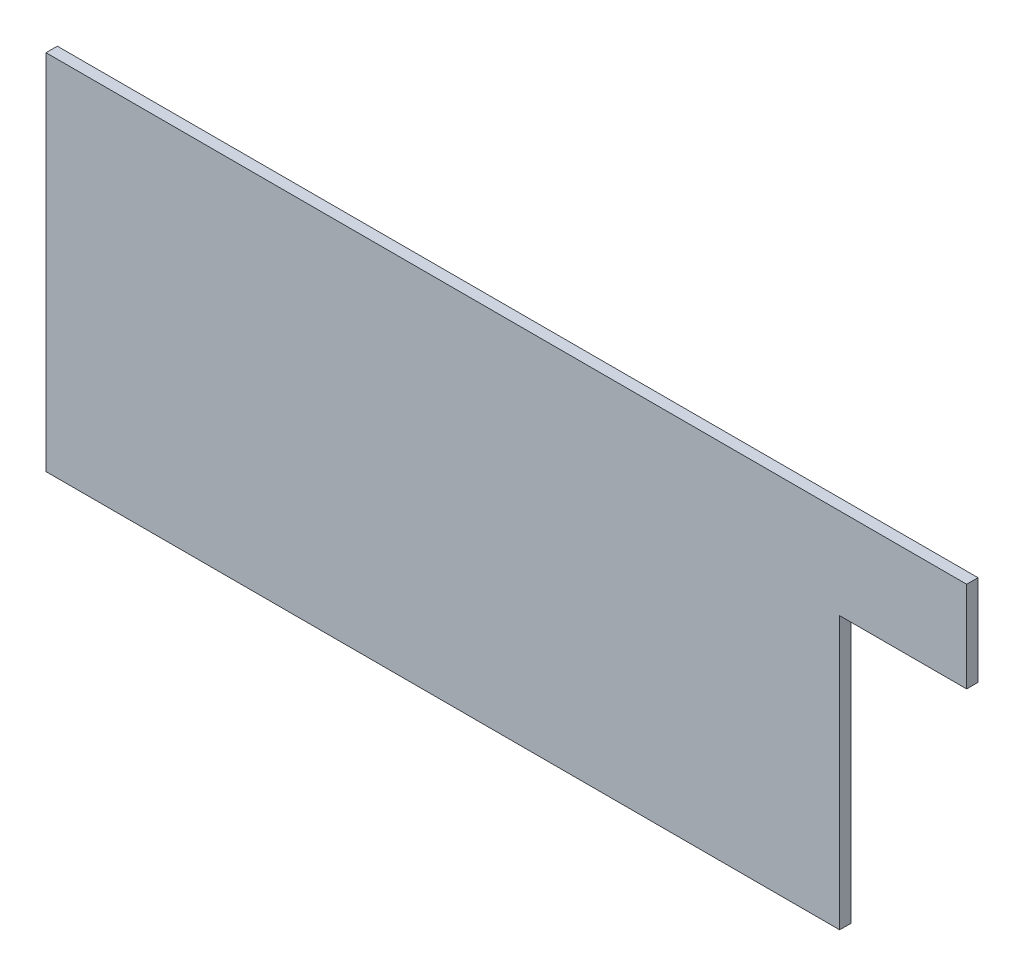
ISO-10303-21;
HEADER;
FILE_DESCRIPTION(('STEP AP214'),'2;1');
FILE_NAME('part.step','',(''),(''),'','','');
FILE_SCHEMA(('AUTOMOTIVE_DESIGN { 1 0 10303 214 1 1 1 1 }'));
ENDSEC;
DATA;
#1=APPLICATION_CONTEXT('core data for automotive mechanical design processes');
#2=APPLICATION_PROTOCOL_DEFINITION('international standard','automotive_design',2000,#1);
#3=PRODUCT_CONTEXT('',#1,'mechanical');
#4=PRODUCT('Part','Part','',(#3));
#5=PRODUCT_RELATED_PRODUCT_CATEGORY('part','',(#4));
#6=PRODUCT_DEFINITION_FORMATION('','',#4);
#7=PRODUCT_DEFINITION_CONTEXT('part definition',#1,'design');
#8=PRODUCT_DEFINITION('design','',#6,#7);
#9=PRODUCT_DEFINITION_SHAPE('','',#8);
#10=(LENGTH_UNIT() NAMED_UNIT(*) SI_UNIT(.MILLI.,.METRE.));
#11=(NAMED_UNIT(*) PLANE_ANGLE_UNIT() SI_UNIT($,.RADIAN.));
#12=(NAMED_UNIT(*) SI_UNIT($,.STERADIAN.) SOLID_ANGLE_UNIT());
#13=UNCERTAINTY_MEASURE_WITH_UNIT(LENGTH_MEASURE(1.E-05),#10,'distance_accuracy_value','');
#14=(GEOMETRIC_REPRESENTATION_CONTEXT(3) GLOBAL_UNCERTAINTY_ASSIGNED_CONTEXT((#13)) GLOBAL_UNIT_ASSIGNED_CONTEXT((#10,
#11,#12)) REPRESENTATION_CONTEXT('',''));
#15=CARTESIAN_POINT('',(0.,0.,0.));
#16=DIRECTION('',(0.,0.,1.));
#17=DIRECTION('',(1.,0.,0.));
#18=AXIS2_PLACEMENT_3D('',#15,#16,#17);
#19=CARTESIAN_POINT('',(0.,0.,3.175));
#20=DIRECTION('',(1.,0.,0.));
#21=DIRECTION('',(0.,0.,-1.));
#22=AXIS2_PLACEMENT_3D('',#19,#20,#21);
#23=PLANE('',#22);
#24=DIRECTION('',(0.,-1.,0.));
#25=VECTOR('',#24,1.);
#26=CARTESIAN_POINT('',(0.,0.,0.));
#27=LINE('',#26,#25);
#28=CARTESIAN_POINT('',(0.,101.6,0.));
#29=VERTEX_POINT('',#28);
#30=CARTESIAN_POINT('',(0.,0.,0.));
#31=VERTEX_POINT('',#30);
#32=EDGE_CURVE('E133',#29,#31,#27,.T.);
#33=ORIENTED_EDGE('',*,*,#32,.T.);
#34=DIRECTION('',(0.,0.,-1.));
#35=VECTOR('',#34,1.);
#36=CARTESIAN_POINT('',(0.,0.,3.175));
#37=LINE('',#36,#35);
#38=CARTESIAN_POINT('',(0.,0.,3.175));
#39=VERTEX_POINT('',#38);
#40=EDGE_CURVE('E11',#39,#31,#37,.T.);
#41=ORIENTED_EDGE('',*,*,#40,.F.);
#42=DIRECTION('',(0.,-1.,0.));
#43=VECTOR('',#42,1.);
#44=CARTESIAN_POINT('',(0.,0.,3.175));
#45=LINE('',#44,#43);
#46=CARTESIAN_POINT('',(0.,101.6,3.175));
#47=VERTEX_POINT('',#46);
#48=EDGE_CURVE('E150',#47,#39,#45,.T.);
#49=ORIENTED_EDGE('',*,*,#48,.F.);
#50=DIRECTION('',(0.,0.,-1.));
#51=VECTOR('',#50,1.);
#52=CARTESIAN_POINT('',(0.,101.6,3.175));
#53=LINE('',#52,#51);
#54=EDGE_CURVE('E129',#47,#29,#53,.T.);
#55=ORIENTED_EDGE('',*,*,#54,.T.);
#56=EDGE_LOOP('',(#33,#41,#49,#55));
#57=FACE_BOUND('',#56,.T.);
#58=ADVANCED_FACE('F43',(#57),#23,.F.);
#59=CARTESIAN_POINT('',(0.,0.,3.175));
#60=DIRECTION('',(0.,1.,0.));
#61=DIRECTION('',(0.,0.,1.));
#62=AXIS2_PLACEMENT_3D('',#59,#60,#61);
#63=PLANE('',#62);
#64=DIRECTION('',(1.,0.,0.));
#65=VECTOR('',#64,1.);
#66=CARTESIAN_POINT('',(0.,0.,0.));
#67=LINE('',#66,#65);
#68=CARTESIAN_POINT('',(222.25,0.,0.));
#69=VERTEX_POINT('',#68);
#70=EDGE_CURVE('E137',#31,#69,#67,.T.);
#71=ORIENTED_EDGE('',*,*,#70,.T.);
#72=DIRECTION('',(0.,0.,-1.));
#73=VECTOR('',#72,1.);
#74=CARTESIAN_POINT('',(222.25,0.,3.175));
#75=LINE('',#74,#73);
#76=CARTESIAN_POINT('',(222.25,0.,3.175));
#77=VERTEX_POINT('',#76);
#78=EDGE_CURVE('E52',#77,#69,#75,.T.);
#79=ORIENTED_EDGE('',*,*,#78,.F.);
#80=DIRECTION('',(1.,0.,0.));
#81=VECTOR('',#80,1.);
#82=CARTESIAN_POINT('',(0.,0.,3.175));
#83=LINE('',#82,#81);
#84=EDGE_CURVE('E95',#39,#77,#83,.T.);
#85=ORIENTED_EDGE('',*,*,#84,.F.);
#86=ORIENTED_EDGE('',*,*,#40,.T.);
#87=EDGE_LOOP('',(#71,#79,#85,#86));
#88=FACE_BOUND('',#87,.T.);
#89=ADVANCED_FACE('F171',(#88),#63,.F.);
#90=CARTESIAN_POINT('',(222.25,76.2,3.175));
#91=DIRECTION('',(-1.,0.,0.));
#92=DIRECTION('',(0.,0.,1.));
#93=AXIS2_PLACEMENT_3D('',#90,#91,#92);
#94=PLANE('',#93);
#95=DIRECTION('',(0.,1.,0.));
#96=VECTOR('',#95,1.);
#97=CARTESIAN_POINT('',(222.25,76.2,0.));
#98=LINE('',#97,#96);
#99=CARTESIAN_POINT('',(222.25,76.2,0.));
#100=VERTEX_POINT('',#99);
#101=EDGE_CURVE('E140',#69,#100,#98,.T.);
#102=ORIENTED_EDGE('',*,*,#101,.T.);
#103=DIRECTION('',(0.,0.,-1.));
#104=VECTOR('',#103,1.);
#105=CARTESIAN_POINT('',(222.25,76.2,3.175));
#106=LINE('',#105,#104);
#107=CARTESIAN_POINT('',(222.25,76.2,3.175));
#108=VERTEX_POINT('',#107);
#109=EDGE_CURVE('E122',#108,#100,#106,.T.);
#110=ORIENTED_EDGE('',*,*,#109,.F.);
#111=DIRECTION('',(0.,1.,0.));
#112=VECTOR('',#111,1.);
#113=CARTESIAN_POINT('',(222.25,76.2,3.175));
#114=LINE('',#113,#112);
#115=EDGE_CURVE('E109',#77,#108,#114,.T.);
#116=ORIENTED_EDGE('',*,*,#115,.F.);
#117=ORIENTED_EDGE('',*,*,#78,.T.);
#118=EDGE_LOOP('',(#102,#110,#116,#117));
#119=FACE_BOUND('',#118,.T.);
#120=ADVANCED_FACE('F160',(#119),#94,.F.);
#121=CARTESIAN_POINT('',(257.81,76.2,3.175));
#122=DIRECTION('',(0.,1.,0.));
#123=DIRECTION('',(-1.,0.,0.));
#124=AXIS2_PLACEMENT_3D('',#121,#122,#123);
#125=PLANE('',#124);
#126=DIRECTION('',(1.,0.,0.));
#127=VECTOR('',#126,1.);
#128=CARTESIAN_POINT('',(257.81,76.2,0.));
#129=LINE('',#128,#127);
#130=CARTESIAN_POINT('',(257.81,76.2,0.));
#131=VERTEX_POINT('',#130);
#132=EDGE_CURVE('E119',#100,#131,#129,.T.);
#133=ORIENTED_EDGE('',*,*,#132,.T.);
#134=DIRECTION('',(0.,0.,-1.));
#135=VECTOR('',#134,1.);
#136=CARTESIAN_POINT('',(257.81,76.2,3.175));
#137=LINE('',#136,#135);
#138=CARTESIAN_POINT('',(257.81,76.2,3.175));
#139=VERTEX_POINT('',#138);
#140=EDGE_CURVE('E116',#139,#131,#137,.T.);
#141=ORIENTED_EDGE('',*,*,#140,.F.);
#142=DIRECTION('',(1.,0.,0.));
#143=VECTOR('',#142,1.);
#144=CARTESIAN_POINT('',(257.81,76.2,3.175));
#145=LINE('',#144,#143);
#146=EDGE_CURVE('E102',#108,#139,#145,.T.);
#147=ORIENTED_EDGE('',*,*,#146,.F.);
#148=ORIENTED_EDGE('',*,*,#109,.T.);
#149=EDGE_LOOP('',(#133,#141,#147,#148));
#150=FACE_BOUND('',#149,.T.);
#151=ADVANCED_FACE('F117',(#150),#125,.F.);
#152=CARTESIAN_POINT('',(257.81,76.2,3.175));
#153=DIRECTION('',(-1.,0.,0.));
#154=DIRECTION('',(0.,0.,1.));
#155=AXIS2_PLACEMENT_3D('',#152,#153,#154);
#156=PLANE('',#155);
#157=DIRECTION('',(0.,1.,0.));
#158=VECTOR('',#157,1.);
#159=CARTESIAN_POINT('',(257.81,76.2,0.));
#160=LINE('',#159,#158);
#161=CARTESIAN_POINT('',(257.81,101.6,0.));
#162=VERTEX_POINT('',#161);
#163=EDGE_CURVE('E145',#131,#162,#160,.T.);
#164=ORIENTED_EDGE('',*,*,#163,.T.);
#165=DIRECTION('',(0.,0.,-1.));
#166=VECTOR('',#165,1.);
#167=CARTESIAN_POINT('',(257.81,101.6,3.175));
#168=LINE('',#167,#166);
#169=CARTESIAN_POINT('',(257.81,101.6,3.175));
#170=VERTEX_POINT('',#169);
#171=EDGE_CURVE('E123',#170,#162,#168,.T.);
#172=ORIENTED_EDGE('',*,*,#171,.F.);
#173=DIRECTION('',(0.,1.,0.));
#174=VECTOR('',#173,1.);
#175=CARTESIAN_POINT('',(257.81,76.2,3.175));
#176=LINE('',#175,#174);
#177=EDGE_CURVE('E106',#139,#170,#176,.T.);
#178=ORIENTED_EDGE('',*,*,#177,.F.);
#179=ORIENTED_EDGE('',*,*,#140,.T.);
#180=EDGE_LOOP('',(#164,#172,#178,#179));
#181=FACE_BOUND('',#180,.T.);
#182=ADVANCED_FACE('F125',(#181),#156,.F.);
#183=CARTESIAN_POINT('',(0.,101.6,3.175));
#184=DIRECTION('',(0.,-1.,0.));
#185=DIRECTION('',(0.,0.,-1.));
#186=AXIS2_PLACEMENT_3D('',#183,#184,#185);
#187=PLANE('',#186);
#188=DIRECTION('',(-1.,0.,0.));
#189=VECTOR('',#188,1.);
#190=CARTESIAN_POINT('',(0.,101.6,0.));
#191=LINE('',#190,#189);
#192=EDGE_CURVE('E83',#162,#29,#191,.T.);
#193=ORIENTED_EDGE('',*,*,#192,.T.);
#194=ORIENTED_EDGE('',*,*,#54,.F.);
#195=DIRECTION('',(-1.,0.,0.));
#196=VECTOR('',#195,1.);
#197=CARTESIAN_POINT('',(165.1,101.6,3.175));
#198=LINE('',#197,#196);
#199=EDGE_CURVE('E60',#170,#47,#198,.T.);
#200=ORIENTED_EDGE('',*,*,#199,.F.);
#201=ORIENTED_EDGE('',*,*,#171,.T.);
#202=EDGE_LOOP('',(#193,#194,#200,#201));
#203=FACE_BOUND('',#202,.T.);
#204=ADVANCED_FACE('F162',(#203),#187,.F.);
#205=CARTESIAN_POINT('',(0.,0.,3.175));
#206=DIRECTION('',(0.,0.,-1.));
#207=DIRECTION('',(-1.,0.,0.));
#208=AXIS2_PLACEMENT_3D('',#205,#206,#207);
#209=PLANE('',#208);
#210=ORIENTED_EDGE('',*,*,#48,.T.);
#211=ORIENTED_EDGE('',*,*,#84,.T.);
#212=ORIENTED_EDGE('',*,*,#115,.T.);
#213=ORIENTED_EDGE('',*,*,#146,.T.);
#214=ORIENTED_EDGE('',*,*,#177,.T.);
#215=ORIENTED_EDGE('',*,*,#199,.T.);
#216=EDGE_LOOP('',(#210,#211,#212,#213,#214,#215));
#217=FACE_BOUND('',#216,.T.);
#218=ADVANCED_FACE('F104',(#217),#209,.F.);
#219=CARTESIAN_POINT('',(0.,0.,0.));
#220=DIRECTION('',(0.,0.,-1.));
#221=DIRECTION('',(-1.,0.,0.));
#222=AXIS2_PLACEMENT_3D('',#219,#220,#221);
#223=PLANE('',#222);
#224=ORIENTED_EDGE('',*,*,#32,.F.);
#225=ORIENTED_EDGE('',*,*,#192,.F.);
#226=ORIENTED_EDGE('',*,*,#163,.F.);
#227=ORIENTED_EDGE('',*,*,#132,.F.);
#228=ORIENTED_EDGE('',*,*,#101,.F.);
#229=ORIENTED_EDGE('',*,*,#70,.F.);
#230=EDGE_LOOP('',(#224,#225,#226,#227,#228,#229));
#231=FACE_BOUND('',#230,.T.);
#232=ADVANCED_FACE('F161',(#231),#223,.T.);
#233=CLOSED_SHELL('',(#58,#89,#120,#151,#182,#204,#218,#232));
#234=MANIFOLD_SOLID_BREP('B2',#233);
#235=ADVANCED_BREP_SHAPE_REPRESENTATION('',(#18,#234),#14);
#236=SHAPE_DEFINITION_REPRESENTATION(#9,#235);
ENDSEC;
END-ISO-10303-21;
